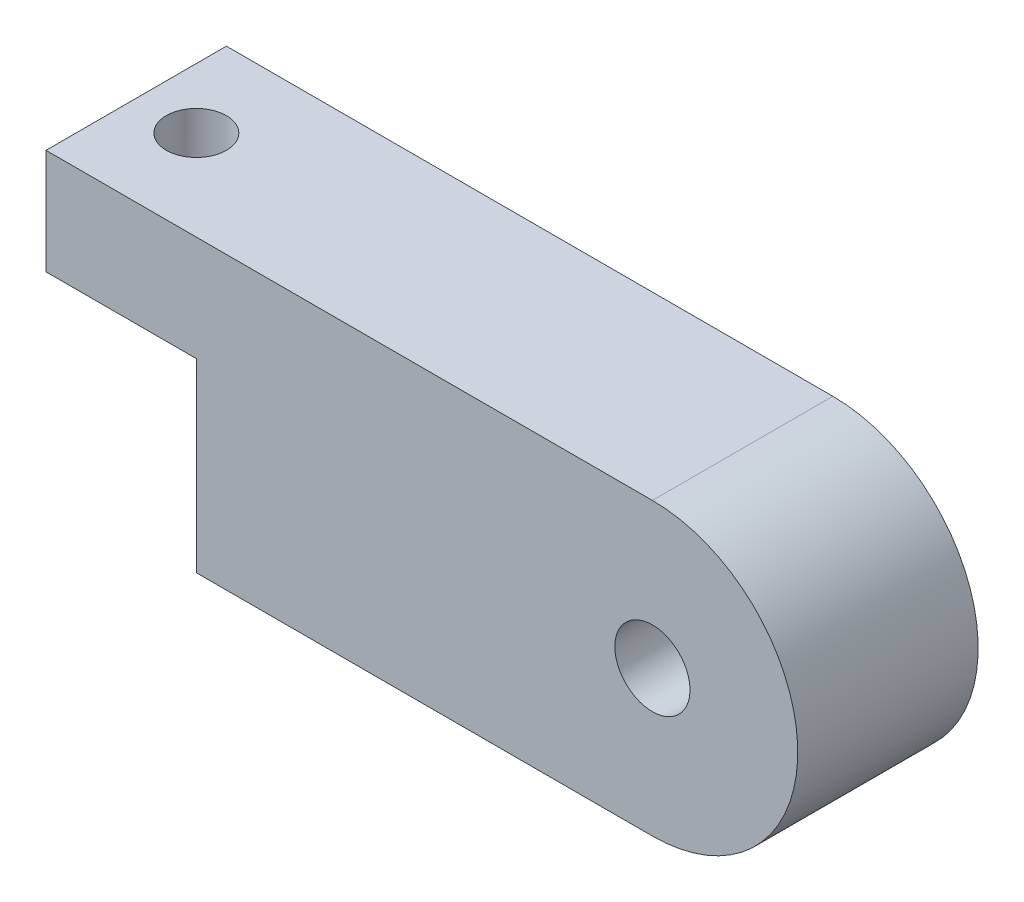
ISO-10303-21;
HEADER;
FILE_DESCRIPTION(('STEP AP214'),'2;1');
FILE_NAME('part.step','',(''),(''),'','','');
FILE_SCHEMA(('AUTOMOTIVE_DESIGN { 1 0 10303 214 1 1 1 1 }'));
ENDSEC;
DATA;
#1=APPLICATION_CONTEXT('core data for automotive mechanical design processes');
#2=APPLICATION_PROTOCOL_DEFINITION('international standard','automotive_design',2000,#1);
#3=PRODUCT_CONTEXT('',#1,'mechanical');
#4=PRODUCT('Part','Part','',(#3));
#5=PRODUCT_RELATED_PRODUCT_CATEGORY('part','',(#4));
#6=PRODUCT_DEFINITION_FORMATION('','',#4);
#7=PRODUCT_DEFINITION_CONTEXT('part definition',#1,'design');
#8=PRODUCT_DEFINITION('design','',#6,#7);
#9=PRODUCT_DEFINITION_SHAPE('','',#8);
#10=(LENGTH_UNIT() NAMED_UNIT(*) SI_UNIT(.MILLI.,.METRE.));
#11=(NAMED_UNIT(*) PLANE_ANGLE_UNIT() SI_UNIT($,.RADIAN.));
#12=(NAMED_UNIT(*) SI_UNIT($,.STERADIAN.) SOLID_ANGLE_UNIT());
#13=UNCERTAINTY_MEASURE_WITH_UNIT(LENGTH_MEASURE(1.E-05),#10,'distance_accuracy_value','');
#14=(GEOMETRIC_REPRESENTATION_CONTEXT(3) GLOBAL_UNCERTAINTY_ASSIGNED_CONTEXT((#13)) GLOBAL_UNIT_ASSIGNED_CONTEXT((#10,
#11,#12)) REPRESENTATION_CONTEXT('',''));
#15=CARTESIAN_POINT('',(0.,0.,0.));
#16=DIRECTION('',(0.,0.,1.));
#17=DIRECTION('',(1.,0.,0.));
#18=AXIS2_PLACEMENT_3D('',#15,#16,#17);
#19=CARTESIAN_POINT('',(151.666666666667,-48.3333333333333,0.));
#20=DIRECTION('',(0.,0.,1.));
#21=DIRECTION('',(1.,0.,0.));
#22=AXIS2_PLACEMENT_3D('',#19,#20,#21);
#23=CYLINDRICAL_SURFACE('',#22,48.3333333333333);
#24=DIRECTION('',(0.,0.,1.));
#25=VECTOR('',#24,1.);
#26=CARTESIAN_POINT('',(151.666666666667,0.,-60.));
#27=LINE('',#26,#25);
#28=CARTESIAN_POINT('',(151.666666666667,0.,0.));
#29=VERTEX_POINT('',#28);
#30=CARTESIAN_POINT('',(151.666666666667,0.,-60.));
#31=VERTEX_POINT('',#30);
#32=EDGE_CURVE('E156',#29,#31,#27,.F.);
#33=ORIENTED_EDGE('',*,*,#32,.F.);
#34=CARTESIAN_POINT('',(151.666666666667,-48.3333333333333,0.));
#35=DIRECTION('',(0.,0.,1.));
#36=DIRECTION('',(1.,0.,0.));
#37=AXIS2_PLACEMENT_3D('',#34,#35,#36);
#38=CIRCLE('',#37,48.3333333333333);
#39=CARTESIAN_POINT('',(151.666666666667,-96.6666666666667,0.));
#40=VERTEX_POINT('',#39);
#41=EDGE_CURVE('E52',#40,#29,#38,.T.);
#42=ORIENTED_EDGE('',*,*,#41,.F.);
#43=DIRECTION('',(0.,0.,1.));
#44=VECTOR('',#43,1.);
#45=CARTESIAN_POINT('',(151.666666666667,-96.6666666666667,-60.));
#46=LINE('',#45,#44);
#47=CARTESIAN_POINT('',(151.666666666667,-96.6666666666667,-60.));
#48=VERTEX_POINT('',#47);
#49=EDGE_CURVE('E160',#48,#40,#46,.T.);
#50=ORIENTED_EDGE('',*,*,#49,.F.);
#51=CARTESIAN_POINT('',(151.666666666667,-48.3333333333333,-60.));
#52=DIRECTION('',(0.,0.,1.));
#53=DIRECTION('',(1.,0.,0.));
#54=AXIS2_PLACEMENT_3D('',#51,#52,#53);
#55=CIRCLE('',#54,48.3333333333333);
#56=EDGE_CURVE('E11',#31,#48,#55,.F.);
#57=ORIENTED_EDGE('',*,*,#56,.F.);
#58=EDGE_LOOP('',(#33,#42,#50,#57));
#59=FACE_BOUND('',#58,.T.);
#60=ADVANCED_FACE('F42',(#59),#23,.T.);
#61=CARTESIAN_POINT('',(0.,0.,-60.));
#62=DIRECTION('',(-1.,0.,0.));
#63=DIRECTION('',(0.,-1.,0.));
#64=AXIS2_PLACEMENT_3D('',#61,#62,#63);
#65=PLANE('',#64);
#66=DIRECTION('',(0.,0.,1.));
#67=VECTOR('',#66,1.);
#68=CARTESIAN_POINT('',(0.,-35.,-60.));
#69=LINE('',#68,#67);
#70=CARTESIAN_POINT('',(0.,-35.,-60.));
#71=VERTEX_POINT('',#70);
#72=CARTESIAN_POINT('',(0.,-35.,0.));
#73=VERTEX_POINT('',#72);
#74=EDGE_CURVE('E59',#71,#73,#69,.T.);
#75=ORIENTED_EDGE('',*,*,#74,.F.);
#76=DIRECTION('',(0.,-1.,0.));
#77=VECTOR('',#76,1.);
#78=CARTESIAN_POINT('',(0.,0.,-60.));
#79=LINE('',#78,#77);
#80=CARTESIAN_POINT('',(0.,-96.6666666666667,-60.));
#81=VERTEX_POINT('',#80);
#82=EDGE_CURVE('E118',#71,#81,#79,.T.);
#83=ORIENTED_EDGE('',*,*,#82,.T.);
#84=DIRECTION('',(0.,0.,1.));
#85=VECTOR('',#84,1.);
#86=CARTESIAN_POINT('',(0.,-96.6666666666667,-60.));
#87=LINE('',#86,#85);
#88=CARTESIAN_POINT('',(0.,-96.6666666666667,0.));
#89=VERTEX_POINT('',#88);
#90=EDGE_CURVE('E144',#81,#89,#87,.T.);
#91=ORIENTED_EDGE('',*,*,#90,.T.);
#92=DIRECTION('',(0.,-1.,0.));
#93=VECTOR('',#92,1.);
#94=CARTESIAN_POINT('',(0.,0.,0.));
#95=LINE('',#94,#93);
#96=EDGE_CURVE('E132',#73,#89,#95,.T.);
#97=ORIENTED_EDGE('',*,*,#96,.F.);
#98=EDGE_LOOP('',(#75,#83,#91,#97));
#99=FACE_BOUND('',#98,.T.);
#100=ADVANCED_FACE('F193',(#99),#65,.T.);
#101=CARTESIAN_POINT('',(0.,0.,-60.));
#102=DIRECTION('',(0.,1.,0.));
#103=DIRECTION('',(0.,0.,1.));
#104=AXIS2_PLACEMENT_3D('',#101,#102,#103);
#105=PLANE('',#104);
#106=CARTESIAN_POINT('',(-30.,0.,-30.));
#107=DIRECTION('',(0.,1.,0.));
#108=DIRECTION('',(0.,0.,1.));
#109=AXIS2_PLACEMENT_3D('',#106,#107,#108);
#110=CIRCLE('',#109,10.);
#111=CARTESIAN_POINT('',(-30.,0.,-20.));
#112=VERTEX_POINT('',#111);
#113=EDGE_CURVE('E181',#112,#112,#110,.T.);
#114=ORIENTED_EDGE('',*,*,#113,.F.);
#115=EDGE_LOOP('',(#114));
#116=FACE_BOUND('',#115,.T.);
#117=DIRECTION('',(-1.,0.,0.));
#118=VECTOR('',#117,1.);
#119=CARTESIAN_POINT('',(0.,0.,0.));
#120=LINE('',#119,#118);
#121=CARTESIAN_POINT('',(-50.,0.,0.));
#122=VERTEX_POINT('',#121);
#123=EDGE_CURVE('E137',#29,#122,#120,.T.);
#124=ORIENTED_EDGE('',*,*,#123,.F.);
#125=ORIENTED_EDGE('',*,*,#32,.T.);
#126=DIRECTION('',(-1.,0.,0.));
#127=VECTOR('',#126,1.);
#128=CARTESIAN_POINT('',(0.,0.,-60.));
#129=LINE('',#128,#127);
#130=CARTESIAN_POINT('',(-50.,0.,-60.));
#131=VERTEX_POINT('',#130);
#132=EDGE_CURVE('E141',#31,#131,#129,.T.);
#133=ORIENTED_EDGE('',*,*,#132,.T.);
#134=DIRECTION('',(0.,0.,-1.));
#135=VECTOR('',#134,1.);
#136=CARTESIAN_POINT('',(-50.,0.,-60.));
#137=LINE('',#136,#135);
#138=EDGE_CURVE('E114',#122,#131,#137,.T.);
#139=ORIENTED_EDGE('',*,*,#138,.F.);
#140=EDGE_LOOP('',(#124,#125,#133,#139));
#141=FACE_BOUND('',#140,.T.);
#142=ADVANCED_FACE('F174',(#116,#141),#105,.T.);
#143=CARTESIAN_POINT('',(0.,-96.6666666666667,-60.));
#144=DIRECTION('',(0.,-1.,0.));
#145=DIRECTION('',(0.,0.,-1.));
#146=AXIS2_PLACEMENT_3D('',#143,#144,#145);
#147=PLANE('',#146);
#148=DIRECTION('',(1.,0.,0.));
#149=VECTOR('',#148,1.);
#150=CARTESIAN_POINT('',(0.,-96.6666666666667,-60.));
#151=LINE('',#150,#149);
#152=EDGE_CURVE('E136',#81,#48,#151,.T.);
#153=ORIENTED_EDGE('',*,*,#152,.T.);
#154=ORIENTED_EDGE('',*,*,#49,.T.);
#155=DIRECTION('',(1.,0.,0.));
#156=VECTOR('',#155,1.);
#157=CARTESIAN_POINT('',(0.,-96.6666666666667,0.));
#158=LINE('',#157,#156);
#159=EDGE_CURVE('E147',#89,#40,#158,.T.);
#160=ORIENTED_EDGE('',*,*,#159,.F.);
#161=ORIENTED_EDGE('',*,*,#90,.F.);
#162=EDGE_LOOP('',(#153,#154,#160,#161));
#163=FACE_BOUND('',#162,.T.);
#164=ADVANCED_FACE('F192',(#163),#147,.T.);
#165=CARTESIAN_POINT('',(0.,0.,-60.));
#166=DIRECTION('',(0.,0.,1.));
#167=DIRECTION('',(1.,0.,0.));
#168=AXIS2_PLACEMENT_3D('',#165,#166,#167);
#169=PLANE('',#168);
#170=CARTESIAN_POINT('',(151.666666666667,-48.3333333333333,-60.));
#171=DIRECTION('',(0.,0.,-1.));
#172=DIRECTION('',(-1.,0.,0.));
#173=AXIS2_PLACEMENT_3D('',#170,#171,#172);
#174=CIRCLE('',#173,12.5);
#175=CARTESIAN_POINT('',(139.166666666667,-48.3333333333333,-60.));
#176=VERTEX_POINT('',#175);
#177=EDGE_CURVE('E120',#176,#176,#174,.T.);
#178=ORIENTED_EDGE('',*,*,#177,.F.);
#179=EDGE_LOOP('',(#178));
#180=FACE_BOUND('',#179,.T.);
#181=ORIENTED_EDGE('',*,*,#132,.F.);
#182=ORIENTED_EDGE('',*,*,#56,.T.);
#183=ORIENTED_EDGE('',*,*,#152,.F.);
#184=ORIENTED_EDGE('',*,*,#82,.F.);
#185=DIRECTION('',(1.,0.,0.));
#186=VECTOR('',#185,1.);
#187=CARTESIAN_POINT('',(-50.,-35.,-60.));
#188=LINE('',#187,#186);
#189=CARTESIAN_POINT('',(-50.,-35.,-60.));
#190=VERTEX_POINT('',#189);
#191=EDGE_CURVE('E100',#190,#71,#188,.T.);
#192=ORIENTED_EDGE('',*,*,#191,.F.);
#193=DIRECTION('',(0.,-1.,0.));
#194=VECTOR('',#193,1.);
#195=CARTESIAN_POINT('',(-50.,0.,-60.));
#196=LINE('',#195,#194);
#197=EDGE_CURVE('E108',#131,#190,#196,.T.);
#198=ORIENTED_EDGE('',*,*,#197,.F.);
#199=EDGE_LOOP('',(#181,#182,#183,#184,#192,#198));
#200=FACE_BOUND('',#199,.T.);
#201=ADVANCED_FACE('F117',(#180,#200),#169,.F.);
#202=CARTESIAN_POINT('',(0.,0.,0.));
#203=DIRECTION('',(0.,0.,1.));
#204=DIRECTION('',(1.,0.,0.));
#205=AXIS2_PLACEMENT_3D('',#202,#203,#204);
#206=PLANE('',#205);
#207=CARTESIAN_POINT('',(151.666666666667,-48.3333333333333,0.));
#208=DIRECTION('',(0.,0.,-1.));
#209=DIRECTION('',(-1.,0.,0.));
#210=AXIS2_PLACEMENT_3D('',#207,#208,#209);
#211=CIRCLE('',#210,12.5);
#212=CARTESIAN_POINT('',(139.166666666667,-48.3333333333333,0.));
#213=VERTEX_POINT('',#212);
#214=EDGE_CURVE('E125',#213,#213,#211,.T.);
#215=ORIENTED_EDGE('',*,*,#214,.T.);
#216=EDGE_LOOP('',(#215));
#217=FACE_BOUND('',#216,.T.);
#218=ORIENTED_EDGE('',*,*,#159,.T.);
#219=ORIENTED_EDGE('',*,*,#41,.T.);
#220=ORIENTED_EDGE('',*,*,#123,.T.);
#221=DIRECTION('',(0.,1.,0.));
#222=VECTOR('',#221,1.);
#223=CARTESIAN_POINT('',(-50.,0.,0.));
#224=LINE('',#223,#222);
#225=CARTESIAN_POINT('',(-50.,-35.,0.));
#226=VERTEX_POINT('',#225);
#227=EDGE_CURVE('E107',#226,#122,#224,.T.);
#228=ORIENTED_EDGE('',*,*,#227,.F.);
#229=DIRECTION('',(1.,0.,0.));
#230=VECTOR('',#229,1.);
#231=CARTESIAN_POINT('',(-50.,-35.,0.));
#232=LINE('',#231,#230);
#233=EDGE_CURVE('E102',#226,#73,#232,.T.);
#234=ORIENTED_EDGE('',*,*,#233,.T.);
#235=ORIENTED_EDGE('',*,*,#96,.T.);
#236=EDGE_LOOP('',(#218,#219,#220,#228,#234,#235));
#237=FACE_BOUND('',#236,.T.);
#238=ADVANCED_FACE('F169',(#217,#237),#206,.T.);
#239=CARTESIAN_POINT('',(151.666666666667,-48.3333333333333,0.));
#240=DIRECTION('',(0.,0.,-1.));
#241=DIRECTION('',(-1.,0.,0.));
#242=AXIS2_PLACEMENT_3D('',#239,#240,#241);
#243=CYLINDRICAL_SURFACE('',#242,12.5);
#244=ORIENTED_EDGE('',*,*,#214,.F.);
#245=EDGE_LOOP('',(#244));
#246=FACE_BOUND('',#245,.T.);
#247=ORIENTED_EDGE('',*,*,#177,.T.);
#248=EDGE_LOOP('',(#247));
#249=FACE_BOUND('',#248,.T.);
#250=ADVANCED_FACE('F234',(#246,#249),#243,.F.);
#251=CARTESIAN_POINT('',(-50.,-35.,-60.));
#252=DIRECTION('',(0.,1.,0.));
#253=DIRECTION('',(-1.,0.,0.));
#254=AXIS2_PLACEMENT_3D('',#251,#252,#253);
#255=PLANE('',#254);
#256=CARTESIAN_POINT('',(-30.,-35.,-30.));
#257=DIRECTION('',(0.,1.,0.));
#258=DIRECTION('',(-1.,0.,0.));
#259=AXIS2_PLACEMENT_3D('',#256,#257,#258);
#260=CIRCLE('',#259,10.);
#261=CARTESIAN_POINT('',(-40.,-35.,-30.));
#262=VERTEX_POINT('',#261);
#263=EDGE_CURVE('E46',#262,#262,#260,.T.);
#264=ORIENTED_EDGE('',*,*,#263,.T.);
#265=EDGE_LOOP('',(#264));
#266=FACE_BOUND('',#265,.T.);
#267=ORIENTED_EDGE('',*,*,#74,.T.);
#268=ORIENTED_EDGE('',*,*,#233,.F.);
#269=DIRECTION('',(0.,0.,1.));
#270=VECTOR('',#269,1.);
#271=CARTESIAN_POINT('',(-50.,-35.,-60.));
#272=LINE('',#271,#270);
#273=EDGE_CURVE('E96',#190,#226,#272,.T.);
#274=ORIENTED_EDGE('',*,*,#273,.F.);
#275=ORIENTED_EDGE('',*,*,#191,.T.);
#276=EDGE_LOOP('',(#267,#268,#274,#275));
#277=FACE_BOUND('',#276,.T.);
#278=ADVANCED_FACE('F98',(#266,#277),#255,.F.);
#279=CARTESIAN_POINT('',(-50.,0.,0.));
#280=DIRECTION('',(-1.,0.,0.));
#281=DIRECTION('',(0.,-1.,0.));
#282=AXIS2_PLACEMENT_3D('',#279,#280,#281);
#283=PLANE('',#282);
#284=ORIENTED_EDGE('',*,*,#197,.T.);
#285=ORIENTED_EDGE('',*,*,#273,.T.);
#286=ORIENTED_EDGE('',*,*,#227,.T.);
#287=ORIENTED_EDGE('',*,*,#138,.T.);
#288=EDGE_LOOP('',(#284,#285,#286,#287));
#289=FACE_BOUND('',#288,.T.);
#290=ADVANCED_FACE('F112',(#289),#283,.T.);
#291=CARTESIAN_POINT('',(-30.,-50.,-30.));
#292=DIRECTION('',(0.,1.,0.));
#293=DIRECTION('',(0.,0.,1.));
#294=AXIS2_PLACEMENT_3D('',#291,#292,#293);
#295=CYLINDRICAL_SURFACE('',#294,10.);
#296=ORIENTED_EDGE('',*,*,#113,.T.);
#297=EDGE_LOOP('',(#296));
#298=FACE_BOUND('',#297,.T.);
#299=ORIENTED_EDGE('',*,*,#263,.F.);
#300=EDGE_LOOP('',(#299));
#301=FACE_BOUND('',#300,.T.);
#302=ADVANCED_FACE('F188',(#298,#301),#295,.F.);
#303=CLOSED_SHELL('',(#60,#100,#142,#164,#201,#238,#250,#278,#290,#302));
#304=MANIFOLD_SOLID_BREP('B2',#303);
#305=ADVANCED_BREP_SHAPE_REPRESENTATION('',(#18,#304),#14);
#306=SHAPE_DEFINITION_REPRESENTATION(#9,#305);
ENDSEC;
END-ISO-10303-21;
